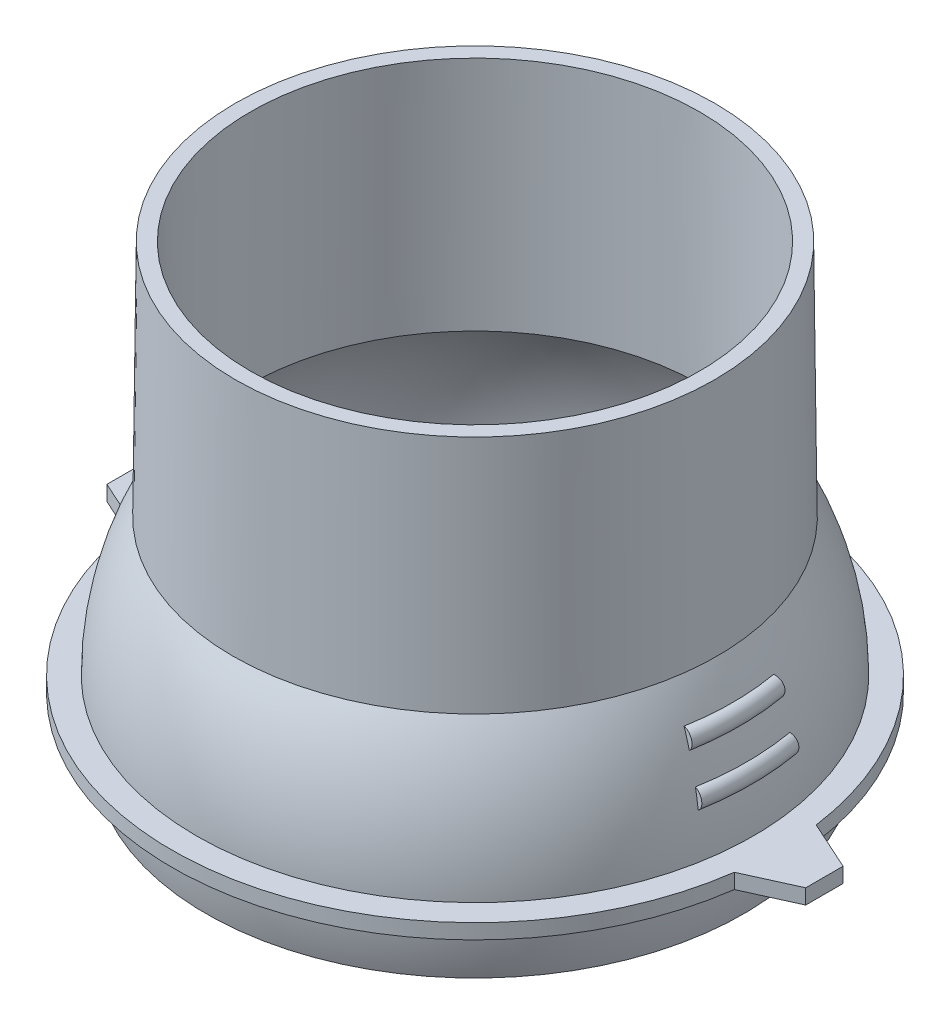
ISO-10303-21;
HEADER;
FILE_DESCRIPTION(('STEP AP214'),'2;1');
FILE_NAME('part.step','',(''),(''),'','','');
FILE_SCHEMA(('AUTOMOTIVE_DESIGN { 1 0 10303 214 1 1 1 1 }'));
ENDSEC;
DATA;
#1=APPLICATION_CONTEXT('core data for automotive mechanical design processes');
#2=APPLICATION_PROTOCOL_DEFINITION('international standard','automotive_design',2000,#1);
#3=PRODUCT_CONTEXT('',#1,'mechanical');
#4=PRODUCT('Part','Part','',(#3));
#5=PRODUCT_RELATED_PRODUCT_CATEGORY('part','',(#4));
#6=PRODUCT_DEFINITION_FORMATION('','',#4);
#7=PRODUCT_DEFINITION_CONTEXT('part definition',#1,'design');
#8=PRODUCT_DEFINITION('design','',#6,#7);
#9=PRODUCT_DEFINITION_SHAPE('','',#8);
#10=(LENGTH_UNIT() NAMED_UNIT(*) SI_UNIT(.MILLI.,.METRE.));
#11=(NAMED_UNIT(*) PLANE_ANGLE_UNIT() SI_UNIT($,.RADIAN.));
#12=(NAMED_UNIT(*) SI_UNIT($,.STERADIAN.) SOLID_ANGLE_UNIT());
#13=UNCERTAINTY_MEASURE_WITH_UNIT(LENGTH_MEASURE(1.E-05),#10,'distance_accuracy_value','');
#14=(GEOMETRIC_REPRESENTATION_CONTEXT(3) GLOBAL_UNCERTAINTY_ASSIGNED_CONTEXT((#13)) GLOBAL_UNIT_ASSIGNED_CONTEXT((#10,
#11,#12)) REPRESENTATION_CONTEXT('',''));
#15=CARTESIAN_POINT('',(0.,0.,0.));
#16=DIRECTION('',(0.,0.,1.));
#17=DIRECTION('',(1.,0.,0.));
#18=AXIS2_PLACEMENT_3D('',#15,#16,#17);
#19=CARTESIAN_POINT('',(0.,17.2974441620263,0.));
#20=DIRECTION('',(0.,-1.,0.));
#21=DIRECTION('',(0.,0.,-1.));
#22=AXIS2_PLACEMENT_3D('',#19,#20,#21);
#23=CYLINDRICAL_SURFACE('',#22,60.7037572717336);
#24=DIRECTION('',(0.,1.,0.));
#25=VECTOR('',#24,1.);
#26=CARTESIAN_POINT('',(-60.1469687207795,-78.2647461199353,-8.2029446302611));
#27=LINE('',#26,#25);
#28=CARTESIAN_POINT('',(-60.1469687207795,-78.2647461199353,-8.20294463026106));
#29=VERTEX_POINT('',#28);
#30=CARTESIAN_POINT('',(-60.1469687207795,-75.2647461199353,-8.2029446302611));
#31=VERTEX_POINT('',#30);
#32=EDGE_CURVE('E244',#29,#31,#27,.T.);
#33=ORIENTED_EDGE('',*,*,#32,.T.);
#34=CARTESIAN_POINT('',(0.,-75.2647461199353,0.));
#35=DIRECTION('',(0.,-1.,0.));
#36=DIRECTION('',(0.,0.,-1.));
#37=AXIS2_PLACEMENT_3D('',#34,#35,#36);
#38=CIRCLE('',#37,60.7037572717336);
#39=CARTESIAN_POINT('',(60.1469687207795,-75.2647461199353,-8.20294463026106));
#40=VERTEX_POINT('',#39);
#41=EDGE_CURVE('E281',#31,#40,#38,.T.);
#42=ORIENTED_EDGE('',*,*,#41,.T.);
#43=DIRECTION('',(0.,1.,0.));
#44=VECTOR('',#43,1.);
#45=CARTESIAN_POINT('',(60.1469687207795,-78.2647461199353,-8.20294463026106));
#46=LINE('',#45,#44);
#47=CARTESIAN_POINT('',(60.1469687207795,-78.2647461199353,-8.20294463026106));
#48=VERTEX_POINT('',#47);
#49=EDGE_CURVE('E273',#48,#40,#46,.T.);
#50=ORIENTED_EDGE('',*,*,#49,.F.);
#51=CARTESIAN_POINT('',(0.,-78.2647461199353,0.));
#52=DIRECTION('',(0.,-1.,0.));
#53=DIRECTION('',(0.,0.,-1.));
#54=AXIS2_PLACEMENT_3D('',#51,#52,#53);
#55=CIRCLE('',#54,60.7037572717336);
#56=EDGE_CURVE('E284',#29,#48,#55,.T.);
#57=ORIENTED_EDGE('',*,*,#56,.F.);
#58=EDGE_LOOP('',(#33,#42,#50,#57));
#59=FACE_BOUND('',#58,.T.);
#60=ADVANCED_FACE('F44',(#59),#23,.T.);
#61=CARTESIAN_POINT('',(0.,-75.2647461199353,1.87350135405495E-13));
#62=DIRECTION('',(0.,1.,0.));
#63=DIRECTION('',(0.,0.,-1.));
#64=AXIS2_PLACEMENT_3D('',#61,#62,#63);
#65=SPHERICAL_SURFACE('',#64,55.784483274368);
#66=CARTESIAN_POINT('',(0.,-78.2647461199353,0.));
#67=DIRECTION('',(0.,-1.,0.));
#68=DIRECTION('',(0.,0.,-1.));
#69=AXIS2_PLACEMENT_3D('',#66,#67,#68);
#70=CIRCLE('',#69,55.7037572717336);
#71=CARTESIAN_POINT('',(0.,-78.2647461199353,-55.7037572717336));
#72=VERTEX_POINT('',#71);
#73=EDGE_CURVE('E288',#72,#72,#70,.T.);
#74=CARTESIAN_POINT('',(0.,-89.7028328125446,0.));
#75=DIRECTION('',(0.,1.,0.));
#76=DIRECTION('',(0.,0.,1.));
#77=AXIS2_PLACEMENT_3D('',#74,#75,#76);
#78=CIRCLE('',#77,53.8836731009024);
#79=CARTESIAN_POINT('',(0.,-89.7028328125446,-53.8836731009024));
#80=VERTEX_POINT('',#79);
#81=EDGE_CURVE('E294',#80,#80,#78,.T.);
#82=CARTESIAN_POINT('',(0.,-78.2647461199353,-55.7037572717336));
#83=CARTESIAN_POINT('',(0.,-78.3854347142406,-55.6972574327962));
#84=CARTESIAN_POINT('',(0.,-78.5061021838576,-55.6903653536044));
#85=CARTESIAN_POINT('',(0.,-78.7473897773534,-55.6757970320156));
#86=CARTESIAN_POINT('',(0.,-78.8680099012322,-55.6681207896186));
#87=CARTESIAN_POINT('',(0.,-79.1091977068898,-55.651984458923));
#88=CARTESIAN_POINT('',(0.,-79.2297653886685,-55.6435243706244));
#89=CARTESIAN_POINT('',(0.,-79.4708432165158,-55.625820707422));
#90=CARTESIAN_POINT('',(0.,-79.5913533625843,-55.6165771325181));
#91=CARTESIAN_POINT('',(0.,-79.832311027688,-55.5973068861235));
#92=CARTESIAN_POINT('',(0.,-79.9527585467232,-55.5872802146328));
#93=CARTESIAN_POINT('',(0.,-80.1935858691215,-55.5664441988043));
#94=CARTESIAN_POINT('',(0.,-80.3139656724846,-55.5556348544665));
#95=CARTESIAN_POINT('',(0.,-80.5546524777504,-55.5332339495793));
#96=CARTESIAN_POINT('',(0.,-80.6749594796532,-55.5216423890298));
#97=CARTESIAN_POINT('',(0.,-80.9154955992886,-55.497677541447));
#98=CARTESIAN_POINT('',(0.,-81.0357247170213,-55.4853042544138));
#99=CARTESIAN_POINT('',(0.,-81.2760999888965,-55.4597764766056));
#100=CARTESIAN_POINT('',(0.,-81.396246143039,-55.4466219858306));
#101=CARTESIAN_POINT('',(0.,-81.6364504118191,-55.4195323562884));
#102=CARTESIAN_POINT('',(0.,-81.7565085264567,-55.4055972175211));
#103=CARTESIAN_POINT('',(0.,-81.9965316440314,-55.3769468807236));
#104=CARTESIAN_POINT('',(0.,-82.1164966469686,-55.3622316826933));
#105=CARTESIAN_POINT('',(0.,-82.356328472881,-55.332021849055));
#106=CARTESIAN_POINT('',(0.,-82.4761952958561,-55.316527213447));
#107=CARTESIAN_POINT('',(0.,-82.7158256977308,-55.284759159268));
#108=CARTESIAN_POINT('',(0.,-82.8355892766302,-55.2684857406971));
#109=CARTESIAN_POINT('',(0.,-83.0750081306015,-55.2351608081089));
#110=CARTESIAN_POINT('',(0.,-83.1946634056733,-55.2181092940918));
#111=CARTESIAN_POINT('',(0.,-83.433860596813,-55.1832288910007));
#112=CARTESIAN_POINT('',(0.,-83.5534025128809,-55.1654000019268));
#113=CARTESIAN_POINT('',(0.,-83.7923679356256,-55.1289656019544));
#114=CARTESIAN_POINT('',(0.,-83.9117914423024,-55.1103600910558));
#115=CARTESIAN_POINT('',(0.,-84.1505150008805,-55.0723732334765));
#116=CARTESIAN_POINT('',(0.,-84.2698150527817,-55.0529918867957));
#117=CARTESIAN_POINT('',(0.,-84.5082866616395,-55.013454176472));
#118=CARTESIAN_POINT('',(0.,-84.6274582185962,-54.9932978128289));
#119=CARTESIAN_POINT('',(0.,-84.8656678028248,-54.9522109201434));
#120=CARTESIAN_POINT('',(0.,-84.9847058300967,-54.9312803911009));
#121=CARTESIAN_POINT('',(0.,-85.2226433258569,-54.8886460518859));
#122=CARTESIAN_POINT('',(0.,-85.3415427943451,-54.8669422417134));
#123=CARTESIAN_POINT('',(0.,-85.5791981492928,-54.8227622571774));
#124=CARTESIAN_POINT('',(0.,-85.6979540357523,-54.8002860828139));
#125=CARTESIAN_POINT('',(0.,-85.9353172094633,-54.7545623194656));
#126=CARTESIAN_POINT('',(0.,-86.0539244967149,-54.7313147304808));
#127=CARTESIAN_POINT('',(0.,-86.2909854611092,-54.6840491200501));
#128=CARTESIAN_POINT('',(0.,-86.4094391382518,-54.6600310986043));
#129=CARTESIAN_POINT('',(0.,-86.6461878780168,-54.6112256379612));
#130=CARTESIAN_POINT('',(0.,-86.7644829406392,-54.5864381987639));
#131=CARTESIAN_POINT('',(0.,-87.0009094536533,-54.5360949498329));
#132=CARTESIAN_POINT('',(0.,-87.1190409040449,-54.5105391400991));
#133=CARTESIAN_POINT('',(0.,-87.3551352018002,-54.4586602297752));
#134=CARTESIAN_POINT('',(0.,-87.4730980491637,-54.4323371291851));
#135=CARTESIAN_POINT('',(0.,-87.7088501571855,-54.3789247492331));
#136=CARTESIAN_POINT('',(0.,-87.8266394178437,-54.3518354698713));
#137=CARTESIAN_POINT('',(0.,-88.0620393761226,-54.2968918768742));
#138=CARTESIAN_POINT('',(0.,-88.1796500737433,-54.269037563239));
#139=CARTESIAN_POINT('',(0.,-88.4146879371158,-54.2125650783492));
#140=CARTESIAN_POINT('',(0.,-88.5321151028676,-54.1839469070946));
#141=CARTESIAN_POINT('',(0.,-88.7667809415859,-54.1259479165089));
#142=CARTESIAN_POINT('',(0.,-88.8840196145525,-54.0965670971778));
#143=CARTESIAN_POINT('',(0.,-89.1183035141457,-54.0370440498968));
#144=CARTESIAN_POINT('',(0.,-89.2353487407724,-54.0069018219469));
#145=CARTESIAN_POINT('',(0.,-89.4692408045496,-53.9458572376585));
#146=CARTESIAN_POINT('',(0.,-89.5860876417002,-53.91495488132));
#147=CARTESIAN_POINT('',(0.,-89.7028328125446,-53.8836731009024));
#148=B_SPLINE_CURVE_WITH_KNOTS('',3,(#82,#83,#84,#85,#86,#87,#88,#89,#90,#91,#92,#93,#94,#95,
#96,#97,#98,#99,#100,#101,#102,#103,#104,#105,#106,#107,#108,#109,#110,#111,#112,#113,#114,#115,
#116,#117,#118,#119,#120,#121,#122,#123,#124,#125,#126,#127,#128,#129,#130,#131,#132,#133,#134,
#135,#136,#137,#138,#139,#140,#141,#142,#143,#144,#145,#146,#147),.UNSPECIFIED.,.F.,.F.,(4,2,2,
2,2,2,2,2,2,2,2,2,2,2,2,2,2,2,2,2,2,2,2,2,2,2,2,2,2,2,2,2,4),(0.,0.362589850057738,
0.725179700115486,1.08776955017322,1.45035940023095,1.81294925028869,2.17553910034642,
2.53812895040417,2.90071880046191,3.26330865051964,3.62589850057737,3.98848835063511,
4.35107820069285,4.71366805075059,5.07625790080832,5.43884775086605,5.80143760092379,
6.16402745098153,6.52661730103927,6.88920715109701,7.25179700115475,7.61438685121248,
7.97697670127021,8.33956655132794,8.70215640138568,9.06474625144342,9.42733610150115,
9.78992595155889,10.1525158016166,10.5151056516744,10.8776955017321,11.2402853517898,
11.6028752018476),.UNSPECIFIED.);
#149=EDGE_CURVE('BSEAM322',#72,#80,#148,.T.);
#150=ORIENTED_EDGE('',*,*,#73,.T.);
#151=ORIENTED_EDGE('',*,*,#81,.T.);
#152=ORIENTED_EDGE('',*,*,#149,.T.);
#153=ORIENTED_EDGE('',*,*,#149,.F.);
#154=EDGE_LOOP('',(#150,#152,#151,#153));
#155=FACE_BOUND('',#154,.T.);
#156=ADVANCED_FACE('F322',(#155),#65,.T.);
#157=CARTESIAN_POINT('',(0.,-74.920900010238,5.55111512312578E-13));
#158=DIRECTION('',(0.,1.,0.));
#159=DIRECTION('',(0.,0.,-1.));
#160=AXIS2_PLACEMENT_3D('',#157,#158,#159);
#161=SPHERICAL_SURFACE('',#160,53.0195501407493);
#162=CARTESIAN_POINT('',(0.,-88.9639128906659,0.));
#163=DIRECTION('',(0.,1.,0.));
#164=DIRECTION('',(0.,0.,1.));
#165=AXIS2_PLACEMENT_3D('',#162,#163,#164);
#166=CIRCLE('',#165,51.1259864097262);
#167=CARTESIAN_POINT('',(0.,-88.9639128906659,-51.1259864097262));
#168=VERTEX_POINT('',#167);
#169=EDGE_CURVE('E291',#168,#168,#166,.T.);
#170=CARTESIAN_POINT('',(0.,-47.7028417193274,0.));
#171=DIRECTION('',(0.,1.,0.));
#172=DIRECTION('',(0.,0.,1.));
#173=AXIS2_PLACEMENT_3D('',#170,#171,#172);
#174=CIRCLE('',#173,45.4999999999997);
#175=CARTESIAN_POINT('',(0.,-47.7028417193274,-45.4999999999997));
#176=VERTEX_POINT('',#175);
#177=EDGE_CURVE('E11',#176,#176,#174,.T.);
#178=CARTESIAN_POINT('',(0.,-88.9639128906659,-51.1259864097262));
#179=CARTESIAN_POINT('',(0.,-88.5340512518878,-51.2440598404657));
#180=CARTESIAN_POINT('',(0.,-88.1026998912801,-51.3567094726339));
#181=CARTESIAN_POINT('',(0.,-87.2372935089862,-51.5710949481167));
#182=CARTESIAN_POINT('',(0.,-86.8032384873001,-51.6728307914313));
#183=CARTESIAN_POINT('',(0.,-85.9327005654302,-51.8653224974955));
#184=CARTESIAN_POINT('',(0.,-85.4962176652464,-51.9560783602451));
#185=CARTESIAN_POINT('',(0.,-84.6211017744714,-52.1265527594063));
#186=CARTESIAN_POINT('',(0.,-84.1824687838801,-52.2062712958178));
#187=CARTESIAN_POINT('',(0.,-83.3033317447734,-52.3546202199727));
#188=CARTESIAN_POINT('',(0.,-82.862827696258,-52.423250607716));
#189=CARTESIAN_POINT('',(0.,-81.9802287972454,-52.5493796000669));
#190=CARTESIAN_POINT('',(0.,-81.5381339467482,-52.6068782046745));
#191=CARTESIAN_POINT('',(0.,-80.6526347029167,-52.7107070425424));
#192=CARTESIAN_POINT('',(0.,-80.2092303095825,-52.7570372758026));
#193=CARTESIAN_POINT('',(0.,-79.3213940747295,-52.8384998976793));
#194=CARTESIAN_POINT('',(0.,-78.8769622332108,-52.8736322862958));
#195=CARTESIAN_POINT('',(0.,-77.9873538496682,-52.9326768670943));
#196=CARTESIAN_POINT('',(0.,-77.5421773076443,-52.9565890592764));
#197=CARTESIAN_POINT('',(0.,-76.6513627447198,-52.9931780344003));
#198=CARTESIAN_POINT('',(0.,-76.2057247238193,-53.005854817342));
#199=CARTESIAN_POINT('',(0.,-75.3142707183178,-53.019964908969));
#200=CARTESIAN_POINT('',(0.,-74.8684547337168,-53.0213982176542));
#201=CARTESIAN_POINT('',(0.,-73.9769284292233,-53.0130204489066));
#202=CARTESIAN_POINT('',(0.,-73.5312181093309,-53.0032093714739));
#203=CARTESIAN_POINT('',(0.,-72.6401866954362,-52.9723490723012));
#204=CARTESIAN_POINT('',(0.,-72.194865601434,-52.9512998505612));
#205=CARTESIAN_POINT('',(0.,-71.3048959528766,-52.8979766543028));
#206=CARTESIAN_POINT('',(0.,-70.8602473983216,-52.8657026797843));
#207=CARTESIAN_POINT('',(0.,-69.9719057143451,-52.7899505106914));
#208=CARTESIAN_POINT('',(0.,-69.5282125849238,-52.7464723161169));
#209=CARTESIAN_POINT('',(0.,-68.6420640290595,-52.6483393677662));
#210=CARTESIAN_POINT('',(0.,-68.1996086026165,-52.5936846139901));
#211=CARTESIAN_POINT('',(0.,-67.3162169431262,-52.4732333186245));
#212=CARTESIAN_POINT('',(0.,-66.8752807100788,-52.4074367770351));
#213=CARTESIAN_POINT('',(0.,-65.995207961285,-52.2647437658435));
#214=CARTESIAN_POINT('',(0.,-65.5560714455386,-52.1878472962414));
#215=CARTESIAN_POINT('',(0.,-64.6798775102709,-52.0230033506063));
#216=CARTESIAN_POINT('',(0.,-64.2428200907497,-51.9350558745732));
#217=CARTESIAN_POINT('',(0.,-63.3710624041342,-51.7481658683152));
#218=CARTESIAN_POINT('',(0.,-62.9363621370398,-51.6492233380902));
#219=CARTESIAN_POINT('',(0.,-62.0695953118585,-51.4404061707469));
#220=CARTESIAN_POINT('',(0.,-61.6375287537715,-51.3305315336286));
#221=CARTESIAN_POINT('',(0.,-60.776304227616,-51.0999200548134));
#222=CARTESIAN_POINT('',(0.,-60.3471462595476,-50.9791832131167));
#223=CARTESIAN_POINT('',(0.,-59.4920119440006,-50.726924137989));
#224=CARTESIAN_POINT('',(0.,-59.0660355965219,-50.5954019045581));
#225=CARTESIAN_POINT('',(0.,-58.2175355285517,-50.3216557205237));
#226=CARTESIAN_POINT('',(0.,-57.79501180806,-50.1794317699203));
#227=CARTESIAN_POINT('',(0.,-56.9536858039909,-49.8843726343761));
#228=CARTESIAN_POINT('',(0.,-56.5348835204134,-49.7315374494353));
#229=CARTESIAN_POINT('',(0.,-55.7012668321707,-49.4153530795433));
#230=CARTESIAN_POINT('',(0.,-55.2864524275054,-49.252003894592));
#231=CARTESIAN_POINT('',(0.,-54.4610754032952,-48.9148954457137));
#232=CARTESIAN_POINT('',(0.,-54.0505127837504,-48.7411361817866));
#233=CARTESIAN_POINT('',(0.,-53.2339005261446,-48.3833181274941));
#234=CARTESIAN_POINT('',(0.,-52.8278508880836,-48.1992593371288));
#235=CARTESIAN_POINT('',(0.,-52.0205229367723,-47.8209593029513));
#236=CARTESIAN_POINT('',(0.,-51.619244623522,-47.6267180591392));
#237=CARTESIAN_POINT('',(0.,-50.8217145619952,-47.2281767889834));
#238=CARTESIAN_POINT('',(0.,-50.4254628137186,-47.0238767626397));
#239=CARTESIAN_POINT('',(0.,-49.6382381768495,-46.6053475504892));
#240=CARTESIAN_POINT('',(0.,-49.2472652882569,-46.3911183646824));
#241=CARTESIAN_POINT('',(0.,-48.4708463648924,-45.9528684427721));
#242=CARTESIAN_POINT('',(0.,-48.0854003301205,-45.7288477066685));
#243=CARTESIAN_POINT('',(0.,-47.7028417193274,-45.4999999999997));
#244=B_SPLINE_CURVE_WITH_KNOTS('',3,(#178,#179,#180,#181,#182,#183,#184,#185,#186,#187,#188,
#189,#190,#191,#192,#193,#194,#195,#196,#197,#198,#199,#200,#201,#202,#203,#204,#205,#206,#207,
#208,#209,#210,#211,#212,#213,#214,#215,#216,#217,#218,#219,#220,#221,#222,#223,#224,#225,#226,
#227,#228,#229,#230,#231,#232,#233,#234,#235,#236,#237,#238,#239,#240,#241,#242,#243),
.UNSPECIFIED.,.F.,.F.,(4,2,2,2,2,2,2,2,2,2,2,2,2,2,2,2,2,2,2,2,2,2,2,2,2,2,2,2,2,2,2,2,4),(0.,
1.33731305102849,2.67462610205699,4.01193915308548,5.34925220411397,6.68656525514247,
8.02387830617096,9.36119135719946,10.6985044082279,12.0358174592564,13.3731305102849,
14.7104435613134,16.0477566123419,17.3850696633704,18.7223827143989,20.0596957654274,
21.3970088164559,22.7343218674844,24.0716349185129,25.4089479695414,26.7462610205699,
28.0835740715983,29.4208871226268,30.7582001736553,32.0955132246838,33.4328262757123,
34.7701393267408,36.1074523777693,37.4447654287978,38.7820784798263,40.1193915308548,
41.4567045818833,42.7940176329118),.UNSPECIFIED.);
#245=EDGE_CURVE('BSEAM46',#168,#176,#244,.T.);
#246=ORIENTED_EDGE('',*,*,#169,.F.);
#247=ORIENTED_EDGE('',*,*,#177,.T.);
#248=ORIENTED_EDGE('',*,*,#245,.T.);
#249=ORIENTED_EDGE('',*,*,#245,.F.);
#250=EDGE_LOOP('',(#246,#248,#247,#249));
#251=FACE_BOUND('',#250,.T.);
#252=ADVANCED_FACE('F46',(#251),#161,.F.);
#253=CARTESIAN_POINT('',(0.,0.,0.));
#254=DIRECTION('',(0.,-1.,0.));
#255=DIRECTION('',(0.,0.,-1.));
#256=AXIS2_PLACEMENT_3D('',#253,#254,#255);
#257=CONICAL_SURFACE('',#256,45.,0.0104811720367967);
#258=ORIENTED_EDGE('',*,*,#177,.F.);
#259=EDGE_LOOP('',(#258));
#260=FACE_BOUND('',#259,.T.);
#261=CARTESIAN_POINT('',(0.,0.,0.));
#262=DIRECTION('',(0.,1.,0.));
#263=DIRECTION('',(0.,0.,1.));
#264=AXIS2_PLACEMENT_3D('',#261,#262,#263);
#265=CIRCLE('',#264,45.);
#266=CARTESIAN_POINT('',(0.,0.,45.));
#267=VERTEX_POINT('',#266);
#268=EDGE_CURVE('E52',#267,#267,#265,.T.);
#269=ORIENTED_EDGE('',*,*,#268,.T.);
#270=EDGE_LOOP('',(#269));
#271=FACE_BOUND('',#270,.T.);
#272=ADVANCED_FACE('F305',(#260,#271),#257,.F.);
#273=CARTESIAN_POINT('',(0.,0.,-45.));
#274=DIRECTION('',(0.,-1.,0.));
#275=DIRECTION('',(0.,0.,-1.));
#276=AXIS2_PLACEMENT_3D('',#273,#274,#275);
#277=PLANE('',#276);
#278=ORIENTED_EDGE('',*,*,#268,.F.);
#279=EDGE_LOOP('',(#278));
#280=FACE_BOUND('',#279,.T.);
#281=CARTESIAN_POINT('',(0.,0.,0.));
#282=DIRECTION('',(0.,1.,0.));
#283=DIRECTION('',(0.,0.,1.));
#284=AXIS2_PLACEMENT_3D('',#281,#282,#283);
#285=CIRCLE('',#284,48.);
#286=CARTESIAN_POINT('',(0.,0.,48.));
#287=VERTEX_POINT('',#286);
#288=EDGE_CURVE('E300',#287,#287,#285,.T.);
#289=ORIENTED_EDGE('',*,*,#288,.T.);
#290=EDGE_LOOP('',(#289));
#291=FACE_BOUND('',#290,.T.);
#292=ADVANCED_FACE('F307',(#280,#291),#277,.F.);
#293=CARTESIAN_POINT('',(0.,-47.7028417193274,0.));
#294=DIRECTION('',(0.,-1.,0.));
#295=DIRECTION('',(0.,0.,-1.));
#296=AXIS2_PLACEMENT_3D('',#293,#294,#295);
#297=CONICAL_SURFACE('',#296,48.4999999999997,0.0104811720367968);
#298=ORIENTED_EDGE('',*,*,#288,.F.);
#299=EDGE_LOOP('',(#298));
#300=FACE_BOUND('',#299,.T.);
#301=CARTESIAN_POINT('',(0.,-47.7028417193274,0.));
#302=DIRECTION('',(0.,1.,0.));
#303=DIRECTION('',(0.,0.,1.));
#304=AXIS2_PLACEMENT_3D('',#301,#302,#303);
#305=CIRCLE('',#304,48.4999999999997);
#306=CARTESIAN_POINT('',(0.,-47.7028417193274,48.4999999999997));
#307=VERTEX_POINT('',#306);
#308=EDGE_CURVE('E297',#307,#307,#305,.T.);
#309=ORIENTED_EDGE('',*,*,#308,.T.);
#310=EDGE_LOOP('',(#309));
#311=FACE_BOUND('',#310,.T.);
#312=ADVANCED_FACE('F310',(#300,#311),#297,.T.);
#313=CARTESIAN_POINT('',(0.,-66.7213752966136,0.));
#314=DIRECTION('',(0.,1.,0.));
#315=DIRECTION('',(0.,0.,-1.));
#316=AXIS2_PLACEMENT_3D('',#313,#314,#315);
#317=CIRCLE('',#316,55.1263946686471);
#318=CARTESIAN_POINT('',(-54.2889008652941,-66.7213752966143,-9.5725979755585));
#319=VERTEX_POINT('',#318);
#320=CARTESIAN_POINT('',(-54.2889008652946,-66.7213752966136,9.5725979755586));
#321=VERTEX_POINT('',#320);
#322=EDGE_CURVE('E64',#319,#321,#317,.T.);
#323=ORIENTED_EDGE('',*,*,#322,.F.);
#324=CARTESIAN_POINT('',(9.50263244022515E-11,-75.2647461199535,1.67557048696722E-11));
#325=DIRECTION('',(-0.173648177666931,0.,0.984807753012208));
#326=DIRECTION('',(0.984807753012208,0.,0.173648177666931));
#327=AXIS2_PLACEMENT_3D('',#324,#325,#326);
#328=CIRCLE('',#327,55.784483274466);
#329=CARTESIAN_POINT('',(-53.6148743653687,-63.100024488472,-9.45374891790917));
#330=VERTEX_POINT('',#329);
#331=EDGE_CURVE('E59',#330,#319,#328,.T.);
#332=ORIENTED_EDGE('',*,*,#331,.F.);
#333=CARTESIAN_POINT('',(0.,-63.1000244884724,0.));
#334=DIRECTION('',(0.,1.,0.));
#335=DIRECTION('',(0.,0.,-1.));
#336=AXIS2_PLACEMENT_3D('',#333,#334,#335);
#337=CIRCLE('',#336,54.4419702235072);
#338=CARTESIAN_POINT('',(-53.6148743653697,-63.1000244884724,9.45374891790933));
#339=VERTEX_POINT('',#338);
#340=EDGE_CURVE('E154',#330,#339,#337,.T.);
#341=ORIENTED_EDGE('',*,*,#340,.T.);
#342=CARTESIAN_POINT('',(9.50263244022515E-11,-75.2647461199535,-1.67557048696722E-11));
#343=DIRECTION('',(0.173648177666931,0.,0.984807753012208));
#344=DIRECTION('',(0.984807753012208,0.,-0.173648177666931));
#345=AXIS2_PLACEMENT_3D('',#342,#343,#344);
#346=CIRCLE('',#345,55.784483274466);
#347=EDGE_CURVE('E159',#339,#321,#346,.T.);
#348=ORIENTED_EDGE('',*,*,#347,.T.);
#349=EDGE_LOOP('',(#323,#332,#341,#348));
#350=FACE_BOUND('',#349,.T.);
#351=CARTESIAN_POINT('',(0.,-57.6638839497852,0.));
#352=DIRECTION('',(0.,1.,0.));
#353=DIRECTION('',(0.,0.,-1.));
#354=AXIS2_PLACEMENT_3D('',#351,#352,#353);
#355=CIRCLE('',#354,52.9350377826975);
#356=CARTESIAN_POINT('',(-52.1308356143948,-57.6638839497847,-9.19207284569558));
#357=VERTEX_POINT('',#356);
#358=CARTESIAN_POINT('',(-52.1308356143947,-57.6638839497852,9.19207284569556));
#359=VERTEX_POINT('',#358);
#360=EDGE_CURVE('E185',#357,#359,#355,.T.);
#361=ORIENTED_EDGE('',*,*,#360,.F.);
#362=CARTESIAN_POINT('',(3.1044483802634E-11,-75.264746119947,5.47398009657131E-12));
#363=DIRECTION('',(-0.173648177666931,0.,0.984807753012208));
#364=DIRECTION('',(0.984807753012208,0.,0.173648177666931));
#365=AXIS2_PLACEMENT_3D('',#362,#363,#364);
#366=CIRCLE('',#365,55.7844832744015);
#367=CARTESIAN_POINT('',(-50.8572780828339,-54.1690214495513,-8.96751029139691));
#368=VERTEX_POINT('',#367);
#369=EDGE_CURVE('E179',#368,#357,#366,.T.);
#370=ORIENTED_EDGE('',*,*,#369,.F.);
#371=CARTESIAN_POINT('',(0.,-54.1690214495508,0.));
#372=DIRECTION('',(0.,1.,0.));
#373=DIRECTION('',(0.,0.,-1.));
#374=AXIS2_PLACEMENT_3D('',#371,#372,#373);
#375=CIRCLE('',#374,51.6418335733692);
#376=CARTESIAN_POINT('',(-50.8572780828201,-54.1690214495508,8.96751029139448));
#377=VERTEX_POINT('',#376);
#378=EDGE_CURVE('E188',#368,#377,#375,.T.);
#379=ORIENTED_EDGE('',*,*,#378,.T.);
#380=CARTESIAN_POINT('',(3.1044483802634E-11,-75.264746119947,-5.47398009657131E-12));
#381=DIRECTION('',(0.173648177666931,0.,0.984807753012208));
#382=DIRECTION('',(0.984807753012208,0.,-0.173648177666931));
#383=AXIS2_PLACEMENT_3D('',#380,#381,#382);
#384=CIRCLE('',#383,55.7844832744015);
#385=EDGE_CURVE('E162',#377,#359,#384,.T.);
#386=ORIENTED_EDGE('',*,*,#385,.T.);
#387=EDGE_LOOP('',(#361,#370,#379,#386));
#388=FACE_BOUND('',#387,.T.);
#389=CARTESIAN_POINT('',(0.,-63.1000244884724,0.));
#390=DIRECTION('',(0.,-1.,0.));
#391=DIRECTION('',(0.,0.,-1.));
#392=AXIS2_PLACEMENT_3D('',#389,#390,#391);
#393=CIRCLE('',#392,54.4419702235072);
#394=CARTESIAN_POINT('',(53.6148743653687,-63.100024488472,-9.45374891790917));
#395=VERTEX_POINT('',#394);
#396=CARTESIAN_POINT('',(53.6148743653698,-63.1000244884723,9.45374891790935));
#397=VERTEX_POINT('',#396);
#398=EDGE_CURVE('E203',#395,#397,#393,.T.);
#399=ORIENTED_EDGE('',*,*,#398,.F.);
#400=CARTESIAN_POINT('',(-9.50263244022515E-11,-75.2647461199535,1.67557048696722E-11));
#401=DIRECTION('',(-0.173648177666931,0.,-0.984807753012208));
#402=DIRECTION('',(-0.984807753012208,0.,0.173648177666931));
#403=AXIS2_PLACEMENT_3D('',#400,#401,#402);
#404=CIRCLE('',#403,55.784483274466);
#405=CARTESIAN_POINT('',(54.2889008652941,-66.7213752966143,-9.5725979755585));
#406=VERTEX_POINT('',#405);
#407=EDGE_CURVE('E196',#395,#406,#404,.T.);
#408=ORIENTED_EDGE('',*,*,#407,.T.);
#409=CARTESIAN_POINT('',(0.,-66.7213752966136,0.));
#410=DIRECTION('',(0.,-1.,0.));
#411=DIRECTION('',(0.,0.,-1.));
#412=AXIS2_PLACEMENT_3D('',#409,#410,#411);
#413=CIRCLE('',#412,55.1263946686471);
#414=CARTESIAN_POINT('',(54.2889008652945,-66.7213752966136,9.57259797555858));
#415=VERTEX_POINT('',#414);
#416=EDGE_CURVE('E201',#406,#415,#413,.T.);
#417=ORIENTED_EDGE('',*,*,#416,.T.);
#418=CARTESIAN_POINT('',(-9.50263244022515E-11,-75.2647461199535,-1.67557048696722E-11));
#419=DIRECTION('',(0.173648177666931,0.,-0.984807753012208));
#420=DIRECTION('',(-0.984807753012208,0.,-0.173648177666931));
#421=AXIS2_PLACEMENT_3D('',#418,#419,#420);
#422=CIRCLE('',#421,55.784483274466);
#423=EDGE_CURVE('E190',#397,#415,#422,.T.);
#424=ORIENTED_EDGE('',*,*,#423,.F.);
#425=EDGE_LOOP('',(#399,#408,#417,#424));
#426=FACE_BOUND('',#425,.T.);
#427=CARTESIAN_POINT('',(0.,-54.1690214495508,0.));
#428=DIRECTION('',(0.,-1.,0.));
#429=DIRECTION('',(0.,0.,-1.));
#430=AXIS2_PLACEMENT_3D('',#427,#428,#429);
#431=CIRCLE('',#430,51.6418335733692);
#432=CARTESIAN_POINT('',(50.8572780828339,-54.1690214495513,-8.96751029139691));
#433=VERTEX_POINT('',#432);
#434=CARTESIAN_POINT('',(50.8572780828202,-54.1690214495508,8.9675102913945));
#435=VERTEX_POINT('',#434);
#436=EDGE_CURVE('E219',#433,#435,#431,.T.);
#437=ORIENTED_EDGE('',*,*,#436,.F.);
#438=CARTESIAN_POINT('',(-3.1044483802634E-11,-75.264746119947,5.47398009657131E-12));
#439=DIRECTION('',(-0.173648177666931,0.,-0.984807753012208));
#440=DIRECTION('',(-0.984807753012208,0.,0.173648177666931));
#441=AXIS2_PLACEMENT_3D('',#438,#439,#440);
#442=CIRCLE('',#441,55.7844832744015);
#443=CARTESIAN_POINT('',(52.1308356143948,-57.6638839497847,-9.19207284569558));
#444=VERTEX_POINT('',#443);
#445=EDGE_CURVE('E212',#433,#444,#442,.T.);
#446=ORIENTED_EDGE('',*,*,#445,.T.);
#447=CARTESIAN_POINT('',(0.,-57.6638839497852,0.));
#448=DIRECTION('',(0.,-1.,0.));
#449=DIRECTION('',(0.,0.,-1.));
#450=AXIS2_PLACEMENT_3D('',#447,#448,#449);
#451=CIRCLE('',#450,52.9350377826975);
#452=CARTESIAN_POINT('',(52.1308356143946,-57.6638839497852,9.19207284569554));
#453=VERTEX_POINT('',#452);
#454=EDGE_CURVE('E217',#444,#453,#451,.T.);
#455=ORIENTED_EDGE('',*,*,#454,.T.);
#456=CARTESIAN_POINT('',(-3.1044483802634E-11,-75.264746119947,-5.47398009657131E-12));
#457=DIRECTION('',(0.173648177666931,0.,-0.984807753012208));
#458=DIRECTION('',(-0.984807753012208,0.,-0.173648177666931));
#459=AXIS2_PLACEMENT_3D('',#456,#457,#458);
#460=CIRCLE('',#459,55.7844832744015);
#461=EDGE_CURVE('E206',#435,#453,#460,.T.);
#462=ORIENTED_EDGE('',*,*,#461,.F.);
#463=EDGE_LOOP('',(#437,#446,#455,#462));
#464=FACE_BOUND('',#463,.T.);
#465=CARTESIAN_POINT('',(0.,-75.2647461199353,0.));
#466=DIRECTION('',(0.,-1.,0.));
#467=DIRECTION('',(0.,0.,-1.));
#468=AXIS2_PLACEMENT_3D('',#465,#466,#467);
#469=CIRCLE('',#468,55.7844832743678);
#470=CARTESIAN_POINT('',(0.,-75.2647461199353,-55.7844832743678));
#471=VERTEX_POINT('',#470);
#472=EDGE_CURVE('E272',#471,#471,#469,.T.);
#473=ORIENTED_EDGE('',*,*,#472,.F.);
#474=EDGE_LOOP('',(#473));
#475=FACE_BOUND('',#474,.T.);
#476=ORIENTED_EDGE('',*,*,#308,.F.);
#477=EDGE_LOOP('',(#476));
#478=FACE_BOUND('',#477,.T.);
#479=ADVANCED_FACE('F156',(#350,#388,#426,#464,#475,#478),#65,.T.);
#480=CARTESIAN_POINT('',(0.,-88.9639128906659,0.));
#481=DIRECTION('',(0.,-1.,0.));
#482=DIRECTION('',(0.,0.,-1.));
#483=AXIS2_PLACEMENT_3D('',#480,#481,#482);
#484=CONICAL_SURFACE('',#483,51.1259864097262,1.30899693899575);
#485=ORIENTED_EDGE('',*,*,#81,.F.);
#486=EDGE_LOOP('',(#485));
#487=FACE_BOUND('',#486,.T.);
#488=ORIENTED_EDGE('',*,*,#169,.T.);
#489=EDGE_LOOP('',(#488));
#490=FACE_BOUND('',#489,.T.);
#491=ADVANCED_FACE('F320',(#487,#490),#484,.F.);
#492=CARTESIAN_POINT('',(0.,-78.2647461199353,-60.7037572717336));
#493=DIRECTION('',(0.,-1.,0.));
#494=DIRECTION('',(0.,0.,-1.));
#495=AXIS2_PLACEMENT_3D('',#492,#493,#494);
#496=PLANE('',#495);
#497=CARTESIAN_POINT('',(60.1469687207795,-78.2647461199353,8.20294463026106));
#498=VERTEX_POINT('',#497);
#499=CARTESIAN_POINT('',(-60.1469687207795,-78.2647461199353,8.20294463026106));
#500=VERTEX_POINT('',#499);
#501=EDGE_CURVE('E285',#498,#500,#55,.T.);
#502=ORIENTED_EDGE('',*,*,#501,.T.);
#503=DIRECTION('',(0.911037132500117,0.,0.412324317990055));
#504=VECTOR('',#503,1.);
#505=CARTESIAN_POINT('',(-70.,-78.2647461199353,3.74358259395157));
#506=LINE('',#505,#504);
#507=CARTESIAN_POINT('',(-70.,-78.2647461199353,3.74358259395157));
#508=VERTEX_POINT('',#507);
#509=EDGE_CURVE('E226',#508,#500,#506,.T.);
#510=ORIENTED_EDGE('',*,*,#509,.F.);
#511=DIRECTION('',(0.,0.,1.));
#512=VECTOR('',#511,1.);
#513=CARTESIAN_POINT('',(-70.,-78.2647461199353,-3.74358259395157));
#514=LINE('',#513,#512);
#515=CARTESIAN_POINT('',(-70.,-78.2647461199353,-3.74358259395157));
#516=VERTEX_POINT('',#515);
#517=EDGE_CURVE('E223',#516,#508,#514,.T.);
#518=ORIENTED_EDGE('',*,*,#517,.F.);
#519=DIRECTION('',(-0.911037132500117,0.,0.412324317990055));
#520=VECTOR('',#519,1.);
#521=CARTESIAN_POINT('',(-70.,-78.2647461199353,-3.74358259395157));
#522=LINE('',#521,#520);
#523=EDGE_CURVE('E230',#29,#516,#522,.T.);
#524=ORIENTED_EDGE('',*,*,#523,.F.);
#525=ORIENTED_EDGE('',*,*,#56,.T.);
#526=DIRECTION('',(-0.911037132500117,0.,-0.412324317990055));
#527=VECTOR('',#526,1.);
#528=CARTESIAN_POINT('',(70.,-78.2647461199353,-3.74358259395157));
#529=LINE('',#528,#527);
#530=CARTESIAN_POINT('',(70.,-78.2647461199353,-3.74358259395157));
#531=VERTEX_POINT('',#530);
#532=EDGE_CURVE('E258',#531,#48,#529,.T.);
#533=ORIENTED_EDGE('',*,*,#532,.F.);
#534=DIRECTION('',(0.,0.,-1.));
#535=VECTOR('',#534,1.);
#536=CARTESIAN_POINT('',(70.,-78.2647461199353,-3.74358259395157));
#537=LINE('',#536,#535);
#538=CARTESIAN_POINT('',(70.,-78.2647461199353,3.74358259395157));
#539=VERTEX_POINT('',#538);
#540=EDGE_CURVE('E254',#539,#531,#537,.T.);
#541=ORIENTED_EDGE('',*,*,#540,.F.);
#542=DIRECTION('',(0.911037132500117,0.,-0.412324317990055));
#543=VECTOR('',#542,1.);
#544=CARTESIAN_POINT('',(70.,-78.2647461199353,3.74358259395157));
#545=LINE('',#544,#543);
#546=EDGE_CURVE('E251',#498,#539,#545,.T.);
#547=ORIENTED_EDGE('',*,*,#546,.F.);
#548=EDGE_LOOP('',(#502,#510,#518,#524,#525,#533,#541,#547));
#549=FACE_BOUND('',#548,.T.);
#550=ORIENTED_EDGE('',*,*,#73,.F.);
#551=EDGE_LOOP('',(#550));
#552=FACE_BOUND('',#551,.T.);
#553=ADVANCED_FACE('F326',(#549,#552),#496,.T.);
#554=DIRECTION('',(0.,1.,0.));
#555=VECTOR('',#554,1.);
#556=CARTESIAN_POINT('',(-60.1469687207795,-78.2647461199353,8.20294463026106));
#557=LINE('',#556,#555);
#558=CARTESIAN_POINT('',(-60.1469687207795,-75.2647461199353,8.20294463026108));
#559=VERTEX_POINT('',#558);
#560=EDGE_CURVE('E247',#500,#559,#557,.T.);
#561=ORIENTED_EDGE('',*,*,#560,.F.);
#562=ORIENTED_EDGE('',*,*,#501,.F.);
#563=DIRECTION('',(0.,1.,0.));
#564=VECTOR('',#563,1.);
#565=CARTESIAN_POINT('',(60.1469687207795,-78.2647461199353,8.20294463026106));
#566=LINE('',#565,#564);
#567=CARTESIAN_POINT('',(60.1469687207795,-75.2647461199353,8.20294463026106));
#568=VERTEX_POINT('',#567);
#569=EDGE_CURVE('E269',#498,#568,#566,.T.);
#570=ORIENTED_EDGE('',*,*,#569,.T.);
#571=EDGE_CURVE('E282',#568,#559,#38,.T.);
#572=ORIENTED_EDGE('',*,*,#571,.T.);
#573=EDGE_LOOP('',(#561,#562,#570,#572));
#574=FACE_BOUND('',#573,.T.);
#575=ADVANCED_FACE('F334',(#574),#23,.T.);
#576=CARTESIAN_POINT('',(0.,-75.2647461199353,-55.7844832743678));
#577=DIRECTION('',(0.,1.,0.));
#578=DIRECTION('',(0.,0.,1.));
#579=AXIS2_PLACEMENT_3D('',#576,#577,#578);
#580=PLANE('',#579);
#581=ORIENTED_EDGE('',*,*,#472,.T.);
#582=EDGE_LOOP('',(#581));
#583=FACE_BOUND('',#582,.T.);
#584=ORIENTED_EDGE('',*,*,#571,.F.);
#585=DIRECTION('',(0.911037132500117,0.,-0.412324317990055));
#586=VECTOR('',#585,1.);
#587=CARTESIAN_POINT('',(70.,-75.2647461199353,3.74358259395157));
#588=LINE('',#587,#586);
#589=CARTESIAN_POINT('',(70.,-75.2647461199353,3.74358259395157));
#590=VERTEX_POINT('',#589);
#591=EDGE_CURVE('E243',#568,#590,#588,.T.);
#592=ORIENTED_EDGE('',*,*,#591,.T.);
#593=DIRECTION('',(0.,0.,-1.));
#594=VECTOR('',#593,1.);
#595=CARTESIAN_POINT('',(70.,-75.2647461199353,-3.74358259395157));
#596=LINE('',#595,#594);
#597=CARTESIAN_POINT('',(70.,-75.2647461199353,-3.74358259395157));
#598=VERTEX_POINT('',#597);
#599=EDGE_CURVE('E264',#590,#598,#596,.T.);
#600=ORIENTED_EDGE('',*,*,#599,.T.);
#601=DIRECTION('',(-0.911037132500117,0.,-0.412324317990055));
#602=VECTOR('',#601,1.);
#603=CARTESIAN_POINT('',(70.,-75.2647461199353,-3.74358259395157));
#604=LINE('',#603,#602);
#605=EDGE_CURVE('E255',#598,#40,#604,.T.);
#606=ORIENTED_EDGE('',*,*,#605,.T.);
#607=ORIENTED_EDGE('',*,*,#41,.F.);
#608=DIRECTION('',(-0.911037132500117,0.,0.412324317990055));
#609=VECTOR('',#608,1.);
#610=CARTESIAN_POINT('',(-70.,-75.2647461199353,-3.74358259395157));
#611=LINE('',#610,#609);
#612=CARTESIAN_POINT('',(-70.,-75.2647461199353,-3.74358259395157));
#613=VERTEX_POINT('',#612);
#614=EDGE_CURVE('E227',#31,#613,#611,.T.);
#615=ORIENTED_EDGE('',*,*,#614,.T.);
#616=DIRECTION('',(0.,0.,1.));
#617=VECTOR('',#616,1.);
#618=CARTESIAN_POINT('',(-70.,-75.2647461199353,-3.74358259395157));
#619=LINE('',#618,#617);
#620=CARTESIAN_POINT('',(-70.,-75.2647461199353,3.74358259395157));
#621=VERTEX_POINT('',#620);
#622=EDGE_CURVE('E222',#613,#621,#619,.T.);
#623=ORIENTED_EDGE('',*,*,#622,.T.);
#624=DIRECTION('',(0.911037132500117,0.,0.412324317990055));
#625=VECTOR('',#624,1.);
#626=CARTESIAN_POINT('',(-70.,-75.2647461199353,3.74358259395157));
#627=LINE('',#626,#625);
#628=EDGE_CURVE('E236',#621,#559,#627,.T.);
#629=ORIENTED_EDGE('',*,*,#628,.T.);
#630=EDGE_LOOP('',(#584,#592,#600,#606,#607,#615,#623,#629));
#631=FACE_BOUND('',#630,.T.);
#632=ADVANCED_FACE('F340',(#583,#631),#580,.T.);
#633=CARTESIAN_POINT('',(70.,-78.2647461199353,3.74358259395157));
#634=DIRECTION('',(0.412324317990055,0.,0.911037132500117));
#635=DIRECTION('',(0.911037132500117,0.,-0.412324317990055));
#636=AXIS2_PLACEMENT_3D('',#633,#634,#635);
#637=PLANE('',#636);
#638=ORIENTED_EDGE('',*,*,#591,.F.);
#639=ORIENTED_EDGE('',*,*,#569,.F.);
#640=ORIENTED_EDGE('',*,*,#546,.T.);
#641=DIRECTION('',(0.,1.,0.));
#642=VECTOR('',#641,1.);
#643=CARTESIAN_POINT('',(70.,-78.2647461199353,3.74358259395157));
#644=LINE('',#643,#642);
#645=EDGE_CURVE('E261',#539,#590,#644,.T.);
#646=ORIENTED_EDGE('',*,*,#645,.T.);
#647=EDGE_LOOP('',(#638,#639,#640,#646));
#648=FACE_BOUND('',#647,.T.);
#649=ADVANCED_FACE('F346',(#648),#637,.T.);
#650=CARTESIAN_POINT('',(70.,-78.2647461199353,-3.74358259395157));
#651=DIRECTION('',(0.412324317990055,0.,-0.911037132500117));
#652=DIRECTION('',(-0.911037132500117,0.,-0.412324317990055));
#653=AXIS2_PLACEMENT_3D('',#650,#651,#652);
#654=PLANE('',#653);
#655=ORIENTED_EDGE('',*,*,#605,.F.);
#656=DIRECTION('',(0.,1.,0.));
#657=VECTOR('',#656,1.);
#658=CARTESIAN_POINT('',(70.,-78.2647461199353,-3.74358259395157));
#659=LINE('',#658,#657);
#660=EDGE_CURVE('E276',#531,#598,#659,.T.);
#661=ORIENTED_EDGE('',*,*,#660,.F.);
#662=ORIENTED_EDGE('',*,*,#532,.T.);
#663=ORIENTED_EDGE('',*,*,#49,.T.);
#664=EDGE_LOOP('',(#655,#661,#662,#663));
#665=FACE_BOUND('',#664,.T.);
#666=ADVANCED_FACE('F376',(#665),#654,.T.);
#667=CARTESIAN_POINT('',(70.,-78.2647461199353,-3.74358259395157));
#668=DIRECTION('',(1.,0.,0.));
#669=DIRECTION('',(0.,0.,-1.));
#670=AXIS2_PLACEMENT_3D('',#667,#668,#669);
#671=PLANE('',#670);
#672=ORIENTED_EDGE('',*,*,#599,.F.);
#673=ORIENTED_EDGE('',*,*,#645,.F.);
#674=ORIENTED_EDGE('',*,*,#540,.T.);
#675=ORIENTED_EDGE('',*,*,#660,.T.);
#676=EDGE_LOOP('',(#672,#673,#674,#675));
#677=FACE_BOUND('',#676,.T.);
#678=ADVANCED_FACE('F371',(#677),#671,.T.);
#679=CARTESIAN_POINT('',(-70.,-78.2647461199353,-3.74358259395157));
#680=DIRECTION('',(-1.,0.,0.));
#681=DIRECTION('',(0.,0.,1.));
#682=AXIS2_PLACEMENT_3D('',#679,#680,#681);
#683=PLANE('',#682);
#684=ORIENTED_EDGE('',*,*,#622,.F.);
#685=DIRECTION('',(0.,1.,0.));
#686=VECTOR('',#685,1.);
#687=CARTESIAN_POINT('',(-70.,-78.2647461199353,-3.74358259395157));
#688=LINE('',#687,#686);
#689=EDGE_CURVE('E241',#516,#613,#688,.T.);
#690=ORIENTED_EDGE('',*,*,#689,.F.);
#691=ORIENTED_EDGE('',*,*,#517,.T.);
#692=DIRECTION('',(0.,1.,0.));
#693=VECTOR('',#692,1.);
#694=CARTESIAN_POINT('',(-70.,-78.2647461199353,3.74358259395157));
#695=LINE('',#694,#693);
#696=EDGE_CURVE('E233',#508,#621,#695,.T.);
#697=ORIENTED_EDGE('',*,*,#696,.T.);
#698=EDGE_LOOP('',(#684,#690,#691,#697));
#699=FACE_BOUND('',#698,.T.);
#700=ADVANCED_FACE('F360',(#699),#683,.T.);
#701=CARTESIAN_POINT('',(-70.,-78.2647461199353,-3.74358259395157));
#702=DIRECTION('',(-0.412324317990055,0.,-0.911037132500117));
#703=DIRECTION('',(-0.911037132500117,0.,0.412324317990055));
#704=AXIS2_PLACEMENT_3D('',#701,#702,#703);
#705=PLANE('',#704);
#706=ORIENTED_EDGE('',*,*,#614,.F.);
#707=ORIENTED_EDGE('',*,*,#32,.F.);
#708=ORIENTED_EDGE('',*,*,#523,.T.);
#709=ORIENTED_EDGE('',*,*,#689,.T.);
#710=EDGE_LOOP('',(#706,#707,#708,#709));
#711=FACE_BOUND('',#710,.T.);
#712=ADVANCED_FACE('F365',(#711),#705,.T.);
#713=CARTESIAN_POINT('',(-70.,-78.2647461199353,3.74358259395157));
#714=DIRECTION('',(-0.412324317990055,0.,0.911037132500117));
#715=DIRECTION('',(0.911037132500117,0.,0.412324317990055));
#716=AXIS2_PLACEMENT_3D('',#713,#714,#715);
#717=PLANE('',#716);
#718=ORIENTED_EDGE('',*,*,#628,.F.);
#719=ORIENTED_EDGE('',*,*,#696,.F.);
#720=ORIENTED_EDGE('',*,*,#509,.T.);
#721=ORIENTED_EDGE('',*,*,#560,.T.);
#722=EDGE_LOOP('',(#718,#719,#720,#721));
#723=FACE_BOUND('',#722,.T.);
#724=ADVANCED_FACE('F357',(#723),#717,.T.);
#725=CARTESIAN_POINT('',(0.,-56.1687129500203,0.));
#726=DIRECTION('',(0.,-1.,0.));
#727=DIRECTION('',(0.,0.,-1.));
#728=AXIS2_PLACEMENT_3D('',#725,#726,#727);
#729=TOROIDAL_SURFACE('',#728,51.606706618619,2.);
#730=CARTESIAN_POINT('',(50.8226847854424,-56.1687129500203,-8.96141055971512));
#731=DIRECTION('',(0.173648177666931,0.,0.984807753012208));
#732=DIRECTION('',(-0.984807753012208,0.,0.173648177666931));
#733=AXIS2_PLACEMENT_3D('',#730,#731,#732);
#734=CIRCLE('',#733,2.);
#735=EDGE_CURVE('E214',#444,#433,#734,.T.);
#736=ORIENTED_EDGE('',*,*,#735,.T.);
#737=ORIENTED_EDGE('',*,*,#436,.T.);
#738=CARTESIAN_POINT('',(50.8226847854424,-56.1687129500203,8.96141055971512));
#739=DIRECTION('',(-0.173648177666931,0.,0.984807753012208));
#740=DIRECTION('',(-0.984807753012208,0.,-0.173648177666931));
#741=AXIS2_PLACEMENT_3D('',#738,#739,#740);
#742=CIRCLE('',#741,2.);
#743=EDGE_CURVE('E209',#453,#435,#742,.T.);
#744=ORIENTED_EDGE('',*,*,#743,.F.);
#745=ORIENTED_EDGE('',*,*,#454,.F.);
#746=EDGE_LOOP('',(#736,#737,#744,#745));
#747=FACE_BOUND('',#746,.T.);
#748=ADVANCED_FACE('F390',(#747),#729,.T.);
#749=CARTESIAN_POINT('',(25.4113423927057,-65.7167295349836,-4.48070527985482));
#750=DIRECTION('',(-0.173648177666931,0.,-0.984807753012208));
#751=DIRECTION('',(-0.984807753012208,0.,0.173648177666931));
#752=AXIS2_PLACEMENT_3D('',#749,#750,#751);
#753=PLANE('',#752);
#754=ORIENTED_EDGE('',*,*,#445,.F.);
#755=ORIENTED_EDGE('',*,*,#735,.F.);
#756=EDGE_LOOP('',(#754,#755));
#757=FACE_BOUND('',#756,.T.);
#758=ADVANCED_FACE('F395',(#757),#753,.T.);
#759=CARTESIAN_POINT('',(25.4113423927057,-65.7167295349836,4.48070527985482));
#760=DIRECTION('',(0.173648177666931,0.,-0.984807753012208));
#761=DIRECTION('',(-0.984807753012208,0.,-0.173648177666931));
#762=AXIS2_PLACEMENT_3D('',#759,#760,#761);
#763=PLANE('',#762);
#764=ORIENTED_EDGE('',*,*,#461,.T.);
#765=ORIENTED_EDGE('',*,*,#743,.T.);
#766=EDGE_LOOP('',(#764,#765));
#767=FACE_BOUND('',#766,.T.);
#768=ADVANCED_FACE('F399',(#767),#763,.F.);
#769=CARTESIAN_POINT('',(0.,-65.0550696952535,0.));
#770=DIRECTION('',(0.,-1.,0.));
#771=DIRECTION('',(0.,0.,-1.));
#772=AXIS2_PLACEMENT_3D('',#769,#770,#771);
#773=TOROIDAL_SURFACE('',#772,54.0203089383007,2.);
#774=CARTESIAN_POINT('',(53.1996190625532,-65.0550696952535,-9.38052820414053));
#775=DIRECTION('',(0.173648177666931,0.,0.984807753012208));
#776=DIRECTION('',(-0.984807753012208,0.,0.173648177666931));
#777=AXIS2_PLACEMENT_3D('',#774,#775,#776);
#778=CIRCLE('',#777,2.);
#779=EDGE_CURVE('E198',#406,#395,#778,.T.);
#780=ORIENTED_EDGE('',*,*,#779,.T.);
#781=ORIENTED_EDGE('',*,*,#398,.T.);
#782=CARTESIAN_POINT('',(53.1996190625532,-65.0550696952535,9.38052820414053));
#783=DIRECTION('',(-0.173648177666931,0.,0.984807753012208));
#784=DIRECTION('',(-0.984807753012208,0.,-0.173648177666931));
#785=AXIS2_PLACEMENT_3D('',#782,#783,#784);
#786=CIRCLE('',#785,2.);
#787=EDGE_CURVE('E193',#415,#397,#786,.T.);
#788=ORIENTED_EDGE('',*,*,#787,.F.);
#789=ORIENTED_EDGE('',*,*,#416,.F.);
#790=EDGE_LOOP('',(#780,#781,#788,#789));
#791=FACE_BOUND('',#790,.T.);
#792=ADVANCED_FACE('F403',(#791),#773,.T.);
#793=CARTESIAN_POINT('',(26.5998095312291,-70.1599079076035,-4.69026410206189));
#794=DIRECTION('',(-0.173648177666931,0.,-0.984807753012208));
#795=DIRECTION('',(-0.984807753012208,0.,0.173648177666931));
#796=AXIS2_PLACEMENT_3D('',#793,#794,#795);
#797=PLANE('',#796);
#798=ORIENTED_EDGE('',*,*,#407,.F.);
#799=ORIENTED_EDGE('',*,*,#779,.F.);
#800=EDGE_LOOP('',(#798,#799));
#801=FACE_BOUND('',#800,.T.);
#802=ADVANCED_FACE('F407',(#801),#797,.T.);
#803=CARTESIAN_POINT('',(26.5998095312291,-70.1599079076035,4.69026410206189));
#804=DIRECTION('',(0.173648177666931,0.,-0.984807753012208));
#805=DIRECTION('',(-0.984807753012208,0.,-0.173648177666931));
#806=AXIS2_PLACEMENT_3D('',#803,#804,#805);
#807=PLANE('',#806);
#808=ORIENTED_EDGE('',*,*,#423,.T.);
#809=ORIENTED_EDGE('',*,*,#787,.T.);
#810=EDGE_LOOP('',(#808,#809));
#811=FACE_BOUND('',#810,.T.);
#812=ADVANCED_FACE('F411',(#811),#807,.F.);
#813=CARTESIAN_POINT('',(0.,-56.1687129500203,0.));
#814=DIRECTION('',(0.,-1.,0.));
#815=DIRECTION('',(0.,0.,-1.));
#816=AXIS2_PLACEMENT_3D('',#813,#814,#815);
#817=TOROIDAL_SURFACE('',#816,51.606706618619,2.);
#818=CARTESIAN_POINT('',(-50.8226847854424,-56.1687129500203,-8.96141055971512));
#819=DIRECTION('',(0.173648177666931,0.,-0.984807753012208));
#820=DIRECTION('',(0.984807753012208,0.,0.173648177666931));
#821=AXIS2_PLACEMENT_3D('',#818,#819,#820);
#822=CIRCLE('',#821,2.);
#823=EDGE_CURVE('E182',#357,#368,#822,.T.);
#824=ORIENTED_EDGE('',*,*,#823,.F.);
#825=ORIENTED_EDGE('',*,*,#360,.T.);
#826=CARTESIAN_POINT('',(-50.8226847854424,-56.1687129500203,8.96141055971512));
#827=DIRECTION('',(-0.173648177666931,0.,-0.984807753012208));
#828=DIRECTION('',(0.984807753012208,0.,-0.173648177666931));
#829=AXIS2_PLACEMENT_3D('',#826,#827,#828);
#830=CIRCLE('',#829,2.);
#831=EDGE_CURVE('E176',#359,#377,#830,.T.);
#832=ORIENTED_EDGE('',*,*,#831,.T.);
#833=ORIENTED_EDGE('',*,*,#378,.F.);
#834=EDGE_LOOP('',(#824,#825,#832,#833));
#835=FACE_BOUND('',#834,.T.);
#836=ADVANCED_FACE('F415',(#835),#817,.T.);
#837=CARTESIAN_POINT('',(-25.4113423927057,-65.7167295349836,-4.48070527985482));
#838=DIRECTION('',(0.173648177666931,0.,-0.984807753012208));
#839=DIRECTION('',(0.984807753012208,0.,0.173648177666931));
#840=AXIS2_PLACEMENT_3D('',#837,#838,#839);
#841=PLANE('',#840);
#842=ORIENTED_EDGE('',*,*,#369,.T.);
#843=ORIENTED_EDGE('',*,*,#823,.T.);
#844=EDGE_LOOP('',(#842,#843));
#845=FACE_BOUND('',#844,.T.);
#846=ADVANCED_FACE('F419',(#845),#841,.T.);
#847=CARTESIAN_POINT('',(-25.4113423927057,-65.7167295349836,4.48070527985482));
#848=DIRECTION('',(-0.173648177666931,0.,-0.984807753012208));
#849=DIRECTION('',(0.984807753012208,0.,-0.173648177666931));
#850=AXIS2_PLACEMENT_3D('',#847,#848,#849);
#851=PLANE('',#850);
#852=ORIENTED_EDGE('',*,*,#385,.F.);
#853=ORIENTED_EDGE('',*,*,#831,.F.);
#854=EDGE_LOOP('',(#852,#853));
#855=FACE_BOUND('',#854,.T.);
#856=ADVANCED_FACE('F423',(#855),#851,.F.);
#857=CARTESIAN_POINT('',(0.,-65.0550696952535,0.));
#858=DIRECTION('',(0.,-1.,0.));
#859=DIRECTION('',(0.,0.,-1.));
#860=AXIS2_PLACEMENT_3D('',#857,#858,#859);
#861=TOROIDAL_SURFACE('',#860,54.0203089383007,2.);
#862=CARTESIAN_POINT('',(-53.1996190625532,-65.0550696952535,-9.38052820414053));
#863=DIRECTION('',(0.173648177666931,0.,-0.984807753012208));
#864=DIRECTION('',(0.984807753012208,0.,0.173648177666931));
#865=AXIS2_PLACEMENT_3D('',#862,#863,#864);
#866=CIRCLE('',#865,2.);
#867=EDGE_CURVE('E172',#319,#330,#866,.T.);
#868=ORIENTED_EDGE('',*,*,#867,.F.);
#869=ORIENTED_EDGE('',*,*,#322,.T.);
#870=CARTESIAN_POINT('',(-53.1996190625532,-65.0550696952535,9.38052820414053));
#871=DIRECTION('',(-0.173648177666931,0.,-0.984807753012208));
#872=DIRECTION('',(0.984807753012208,0.,-0.173648177666931));
#873=AXIS2_PLACEMENT_3D('',#870,#871,#872);
#874=CIRCLE('',#873,2.);
#875=EDGE_CURVE('E164',#321,#339,#874,.T.);
#876=ORIENTED_EDGE('',*,*,#875,.T.);
#877=ORIENTED_EDGE('',*,*,#340,.F.);
#878=EDGE_LOOP('',(#868,#869,#876,#877));
#879=FACE_BOUND('',#878,.T.);
#880=ADVANCED_FACE('F165',(#879),#861,.T.);
#881=CARTESIAN_POINT('',(-26.5998095312291,-70.1599079076035,-4.69026410206189));
#882=DIRECTION('',(0.173648177666931,0.,-0.984807753012208));
#883=DIRECTION('',(0.984807753012208,0.,0.173648177666931));
#884=AXIS2_PLACEMENT_3D('',#881,#882,#883);
#885=PLANE('',#884);
#886=ORIENTED_EDGE('',*,*,#331,.T.);
#887=ORIENTED_EDGE('',*,*,#867,.T.);
#888=EDGE_LOOP('',(#886,#887));
#889=FACE_BOUND('',#888,.T.);
#890=ADVANCED_FACE('F430',(#889),#885,.T.);
#891=CARTESIAN_POINT('',(-26.5998095312291,-70.1599079076035,4.69026410206189));
#892=DIRECTION('',(-0.173648177666931,0.,-0.984807753012208));
#893=DIRECTION('',(0.984807753012208,0.,-0.173648177666931));
#894=AXIS2_PLACEMENT_3D('',#891,#892,#893);
#895=PLANE('',#894);
#896=ORIENTED_EDGE('',*,*,#347,.F.);
#897=ORIENTED_EDGE('',*,*,#875,.F.);
#898=EDGE_LOOP('',(#896,#897));
#899=FACE_BOUND('',#898,.T.);
#900=ADVANCED_FACE('F168',(#899),#895,.F.);
#901=CLOSED_SHELL('',(#60,#156,#252,#272,#292,#312,#479,#491,#553,#575,#632,#649,#666,#678,#700,
#712,#724,#748,#758,#768,#792,#802,#812,#836,#846,#856,#880,#890,#900));
#902=MANIFOLD_SOLID_BREP('B2',#901);
#903=ADVANCED_BREP_SHAPE_REPRESENTATION('',(#18,#902),#14);
#904=SHAPE_DEFINITION_REPRESENTATION(#9,#903);
ENDSEC;
END-ISO-10303-21;
